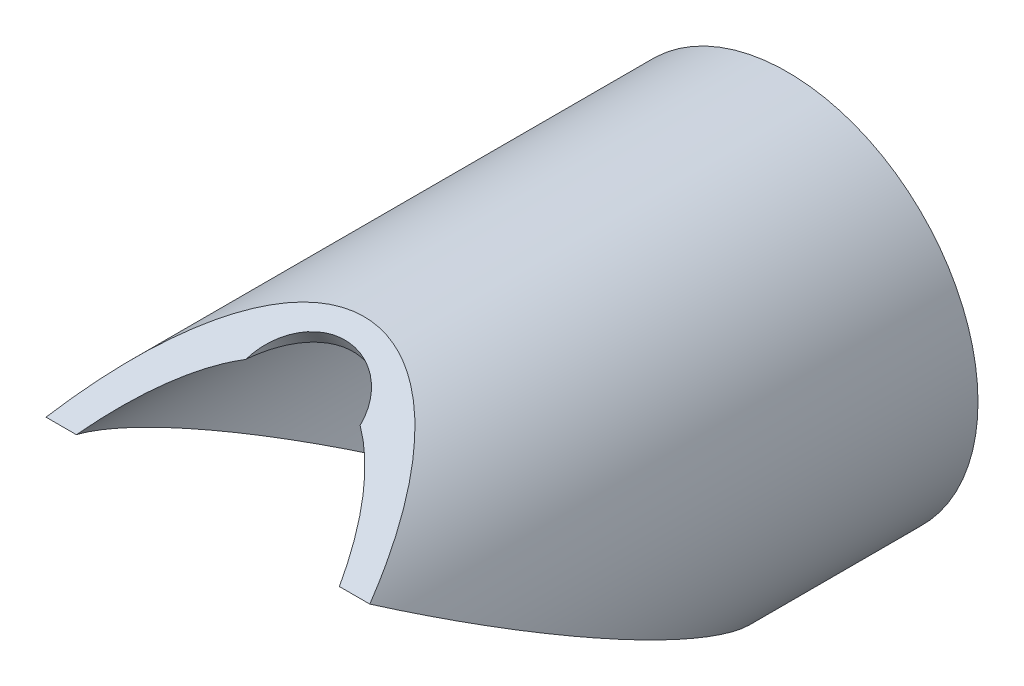
ISO-10303-21;
HEADER;
FILE_DESCRIPTION(('STEP AP214'),'2;1');
FILE_NAME('part.step','',(''),(''),'','','');
FILE_SCHEMA(('AUTOMOTIVE_DESIGN { 1 0 10303 214 1 1 1 1 }'));
ENDSEC;
DATA;
#1=APPLICATION_CONTEXT('core data for automotive mechanical design processes');
#2=APPLICATION_PROTOCOL_DEFINITION('international standard','automotive_design',2000,#1);
#3=PRODUCT_CONTEXT('',#1,'mechanical');
#4=PRODUCT('Part','Part','',(#3));
#5=PRODUCT_RELATED_PRODUCT_CATEGORY('part','',(#4));
#6=PRODUCT_DEFINITION_FORMATION('','',#4);
#7=PRODUCT_DEFINITION_CONTEXT('part definition',#1,'design');
#8=PRODUCT_DEFINITION('design','',#6,#7);
#9=PRODUCT_DEFINITION_SHAPE('','',#8);
#10=(LENGTH_UNIT() NAMED_UNIT(*) SI_UNIT(.MILLI.,.METRE.));
#11=(NAMED_UNIT(*) PLANE_ANGLE_UNIT() SI_UNIT($,.RADIAN.));
#12=(NAMED_UNIT(*) SI_UNIT($,.STERADIAN.) SOLID_ANGLE_UNIT());
#13=UNCERTAINTY_MEASURE_WITH_UNIT(LENGTH_MEASURE(1.E-05),#10,'distance_accuracy_value','');
#14=(GEOMETRIC_REPRESENTATION_CONTEXT(3) GLOBAL_UNCERTAINTY_ASSIGNED_CONTEXT((#13)) GLOBAL_UNIT_ASSIGNED_CONTEXT((#10,
#11,#12)) REPRESENTATION_CONTEXT('',''));
#15=CARTESIAN_POINT('',(0.,0.,0.));
#16=DIRECTION('',(0.,0.,1.));
#17=DIRECTION('',(1.,0.,0.));
#18=AXIS2_PLACEMENT_3D('',#15,#16,#17);
#19=CARTESIAN_POINT('',(0.,0.,-177.8));
#20=DIRECTION('',(0.,0.,1.));
#21=DIRECTION('',(1.,0.,0.));
#22=AXIS2_PLACEMENT_3D('',#19,#20,#21);
#23=CYLINDRICAL_SURFACE('',#22,83.4771);
#24=CARTESIAN_POINT('',(0.,0.,152.4));
#25=DIRECTION('',(0.,-0.866025403784438,-0.500000000000001));
#26=DIRECTION('',(0.,-0.500000000000001,0.866025403784438));
#27=AXIS2_PLACEMENT_3D('',#24,#25,#26);
#28=ELLIPSE('',#27,166.9542,83.4771);
#29=CARTESIAN_POINT('',(70.9432605989462,43.9940905122496,76.1999999999998));
#30=VERTEX_POINT('',#29);
#31=CARTESIAN_POINT('',(-70.9432605989462,43.9940905122495,76.1999999999999));
#32=VERTEX_POINT('',#31);
#33=EDGE_CURVE('E58',#30,#32,#28,.F.);
#34=ORIENTED_EDGE('',*,*,#33,.F.);
#35=CARTESIAN_POINT('',(0.,0.,-1.11022302462516E-13));
#36=DIRECTION('',(0.,0.866025403784438,-0.500000000000001));
#37=DIRECTION('',(0.,0.500000000000001,0.866025403784438));
#38=AXIS2_PLACEMENT_3D('',#35,#36,#37);
#39=ELLIPSE('',#38,166.9542,83.4771);
#40=EDGE_CURVE('E92',#32,#30,#39,.F.);
#41=ORIENTED_EDGE('',*,*,#40,.F.);
#42=EDGE_LOOP('',(#34,#41));
#43=FACE_BOUND('',#42,.T.);
#44=CARTESIAN_POINT('',(0.,0.,-177.8));
#45=DIRECTION('',(0.,0.,1.));
#46=DIRECTION('',(1.,0.,0.));
#47=AXIS2_PLACEMENT_3D('',#44,#45,#46);
#48=CIRCLE('',#47,83.4771);
#49=CARTESIAN_POINT('',(83.4771,0.,-177.8));
#50=VERTEX_POINT('',#49);
#51=EDGE_CURVE('E98',#50,#50,#48,.T.);
#52=ORIENTED_EDGE('',*,*,#51,.T.);
#53=EDGE_LOOP('',(#52));
#54=FACE_BOUND('',#53,.T.);
#55=ADVANCED_FACE('F37',(#43,#54),#23,.T.);
#56=CARTESIAN_POINT('',(0.,0.,-177.8));
#57=DIRECTION('',(0.,0.,1.));
#58=DIRECTION('',(1.,0.,0.));
#59=AXIS2_PLACEMENT_3D('',#56,#57,#58);
#60=PLANE('',#59);
#61=CARTESIAN_POINT('',(0.,0.,-177.8));
#62=DIRECTION('',(0.,0.,1.));
#63=DIRECTION('',(1.,0.,0.));
#64=AXIS2_PLACEMENT_3D('',#61,#62,#63);
#65=CIRCLE('',#64,72.5043);
#66=CARTESIAN_POINT('',(72.5043,0.,-177.8));
#67=VERTEX_POINT('',#66);
#68=EDGE_CURVE('E95',#67,#67,#65,.T.);
#69=ORIENTED_EDGE('',*,*,#68,.T.);
#70=EDGE_LOOP('',(#69));
#71=FACE_BOUND('',#70,.T.);
#72=ORIENTED_EDGE('',*,*,#51,.F.);
#73=EDGE_LOOP('',(#72));
#74=FACE_BOUND('',#73,.T.);
#75=ADVANCED_FACE('F106',(#71,#74),#60,.F.);
#76=CARTESIAN_POINT('',(0.,0.,-177.8));
#77=DIRECTION('',(0.,0.,1.));
#78=DIRECTION('',(1.,0.,0.));
#79=AXIS2_PLACEMENT_3D('',#76,#77,#78);
#80=CYLINDRICAL_SURFACE('',#79,72.5043);
#81=CARTESIAN_POINT('',(0.,0.,152.4));
#82=DIRECTION('',(0.,-0.866025403784438,-0.500000000000001));
#83=DIRECTION('',(0.,-0.500000000000001,0.866025403784438));
#84=AXIS2_PLACEMENT_3D('',#81,#82,#83);
#85=ELLIPSE('',#84,145.0086,72.5043);
#86=CARTESIAN_POINT('',(57.6315323281447,43.9940905122496,76.1999999999998));
#87=VERTEX_POINT('',#86);
#88=CARTESIAN_POINT('',(25.0698350392662,68.0321753995415,34.5648156585567));
#89=VERTEX_POINT('',#88);
#90=EDGE_CURVE('E79',#87,#89,#85,.F.);
#91=ORIENTED_EDGE('',*,*,#90,.T.);
#92=CARTESIAN_POINT('',(25.0698350392662,68.0321753995415,34.5648156585567));
#93=CARTESIAN_POINT('',(25.0165885277715,68.0517928913347,34.1985523659614));
#94=CARTESIAN_POINT('',(24.956740588473,68.0737801424833,33.8334072238118));
#95=CARTESIAN_POINT('',(24.8236149250687,68.1224396249137,33.105860239065));
#96=CARTESIAN_POINT('',(24.7503361582136,68.1491122199519,32.7434586117467));
#97=CARTESIAN_POINT('',(24.5099784340862,68.2360886768719,31.6609956452087));
#98=CARTESIAN_POINT('',(24.3224101262156,68.3033392260635,30.9458993658768));
#99=CARTESIAN_POINT('',(23.8912326372038,68.4553487073951,29.533502917939));
#100=CARTESIAN_POINT('',(23.6475359451464,68.5401349585247,28.836232447922));
#101=CARTESIAN_POINT('',(23.1038219270062,68.7253181299231,27.4662314597167));
#102=CARTESIAN_POINT('',(22.803815304171,68.8257120828981,26.7934963068932));
#103=CARTESIAN_POINT('',(22.1466084736116,69.0399960430664,25.47568013842));
#104=CARTESIAN_POINT('',(21.7892060113447,69.1539333919807,24.8307075414304));
#105=CARTESIAN_POINT('',(21.0192001545897,69.3918512263008,23.5764573624981));
#106=CARTESIAN_POINT('',(20.6065928267358,69.5158324270859,22.9671823284712));
#107=CARTESIAN_POINT('',(19.7289802480364,69.7699730931827,21.7903591552694));
#108=CARTESIAN_POINT('',(19.2640497887339,69.9001235896648,21.2227533251233));
#109=CARTESIAN_POINT('',(18.284338145138,70.1627645627701,20.1329558249374));
#110=CARTESIAN_POINT('',(17.7695601311963,70.2952548901401,19.6107612707016));
#111=CARTESIAN_POINT('',(16.7252920940473,70.5507613544295,18.6448000098467));
#112=CARTESIAN_POINT('',(16.1984110410808,70.6738793897599,18.198235469563));
#113=CARTESIAN_POINT('',(15.1073953921869,70.915105201323,17.3517169776958));
#114=CARTESIAN_POINT('',(14.5432620886039,71.033213151131,16.9517614104966));
#115=CARTESIAN_POINT('',(13.3814627884086,71.2612133547351,16.20060703784));
#116=CARTESIAN_POINT('',(12.7837808053427,71.3711016325495,15.8494317586672));
#117=CARTESIAN_POINT('',(11.5594294623794,71.5795968191336,15.1979439210552));
#118=CARTESIAN_POINT('',(10.932759925942,71.6782036591844,14.8976316724341));
#119=CARTESIAN_POINT('',(9.66090382141489,71.8606242713493,14.3519041162073));
#120=CARTESIAN_POINT('',(9.01594323275082,71.9445669058997,14.1060049434376));
#121=CARTESIAN_POINT('',(7.70657928314601,72.0965776142214,13.6666921339268));
#122=CARTESIAN_POINT('',(7.04217611950407,72.1646458490196,13.4732779647844));
#123=CARTESIAN_POINT('',(5.69867883177629,72.2831464122852,13.1397686482924));
#124=CARTESIAN_POINT('',(5.01958670738071,72.3335811254559,12.9996662909905));
#125=CARTESIAN_POINT('',(3.65135942817979,72.4155424196428,12.7733011821701));
#126=CARTESIAN_POINT('',(2.96222417829195,72.4470688215267,12.6870389407179));
#127=CARTESIAN_POINT('',(1.57199403204947,72.4906246319545,12.5681146715126));
#128=CARTESIAN_POINT('',(0.870847952227655,72.5024621775654,12.5359800659159));
#129=CARTESIAN_POINT('',(-0.531846092435393,72.5057415617375,12.527064172752));
#130=CARTESIAN_POINT('',(-1.23339405971799,72.4971832750567,12.5502832250879));
#131=CARTESIAN_POINT('',(-2.63198124091519,72.4598895008166,12.6519892436832));
#132=CARTESIAN_POINT('',(-3.32902015188525,72.4311526714674,12.7304798852763));
#133=CARTESIAN_POINT('',(-4.71360562256787,72.3542410829171,12.9424263177474));
#134=CARTESIAN_POINT('',(-5.40115218372202,72.3060663266681,13.0758821002776));
#135=CARTESIAN_POINT('',(-6.76375929696585,72.1913696585393,13.3976671298747));
#136=CARTESIAN_POINT('',(-7.43877979200651,72.1247970780674,13.5861480010025));
#137=CARTESIAN_POINT('',(-8.76950645216229,71.9751180190198,14.0170340885756));
#138=CARTESIAN_POINT('',(-9.42521256268965,71.8920114937199,14.2594394574098));
#139=CARTESIAN_POINT('',(-10.7125662950733,71.7114840657611,14.7970692404264));
#140=CARTESIAN_POINT('',(-11.3442138498504,71.6140631231949,15.0922938018646));
#141=CARTESIAN_POINT('',(-12.5788557975641,71.4075464769165,15.7341069734703));
#142=CARTESIAN_POINT('',(-13.1818504327079,71.2984508719172,16.0806951493521));
#143=CARTESIAN_POINT('',(-14.3511756614534,71.0722854503071,16.8210772304806));
#144=CARTESIAN_POINT('',(-14.917710485105,70.95526929688,17.2145649748107));
#145=CARTESIAN_POINT('',(-16.0141548417676,70.7158773116178,18.048177319327));
#146=CARTESIAN_POINT('',(-16.544064514553,70.59350150024,18.4883017415152));
#147=CARTESIAN_POINT('',(-17.563435319644,70.3468139847023,19.4122811465894));
#148=CARTESIAN_POINT('',(-18.0529107454302,70.2225029832589,19.8961205485271));
#149=CARTESIAN_POINT('',(-18.9884401238628,69.9753300947118,20.9044186260631));
#150=CARTESIAN_POINT('',(-19.4344949550721,69.8524681783319,21.4288764794105));
#151=CARTESIAN_POINT('',(-20.2771139566889,69.6125174026009,22.5102526769614));
#152=CARTESIAN_POINT('',(-20.6740533353418,69.4953895208999,23.066870186394));
#153=CARTESIAN_POINT('',(-21.4207527464433,69.2688759616954,24.2124086836965));
#154=CARTESIAN_POINT('',(-21.7705107747348,69.1594906131709,24.8013310423096));
#155=CARTESIAN_POINT('',(-22.4217091516028,68.9511236494955,26.007352678234));
#156=CARTESIAN_POINT('',(-22.7231290674682,68.8521464399604,26.6244637301465));
#157=CARTESIAN_POINT('',(-23.2768744591298,68.6669204181907,27.8820565303071));
#158=CARTESIAN_POINT('',(-23.5292089719207,68.5806692637006,28.5225339507951));
#159=CARTESIAN_POINT('',(-23.9101092247501,68.4485668779816,29.6089397291921));
#160=CARTESIAN_POINT('',(-24.0521175716089,68.3987461933586,30.0497405307472));
#161=CARTESIAN_POINT('',(-24.3142189946274,68.3060143715923,30.938470008998));
#162=CARTESIAN_POINT('',(-24.4343154470696,68.2631021700792,31.3863975759864));
#163=CARTESIAN_POINT('',(-24.6525663768309,68.1845878294803,32.2868336659188));
#164=CARTESIAN_POINT('',(-24.7507817201006,68.1489654356758,32.7393257269689));
#165=CARTESIAN_POINT('',(-24.9260728986618,68.0850398241241,33.6489221155905));
#166=CARTESIAN_POINT('',(-25.0031478627745,68.0567369080097,34.1060266324334));
#167=CARTESIAN_POINT('',(-25.0698350392662,68.0321753995415,34.5648156585566));
#168=B_SPLINE_CURVE_WITH_KNOTS('',3,(#92,#93,#94,#95,#96,#97,#98,#99,#100,#101,#102,#103,#104,
#105,#106,#107,#108,#109,#110,#111,#112,#113,#114,#115,#116,#117,#118,#119,#120,#121,#122,#123,
#124,#125,#126,#127,#128,#129,#130,#131,#132,#133,#134,#135,#136,#137,#138,#139,#140,#141,#142,
#143,#144,#145,#146,#147,#148,#149,#150,#151,#152,#153,#154,#155,#156,#157,#158,#159,#160,#161,
#162,#163,#164,#165,#166,#167),.UNSPECIFIED.,.F.,.F.,(4,2,2,2,2,2,2,2,2,2,2,2,2,2,2,2,2,2,2,2,2,
2,2,2,2,2,2,2,2,2,2,2,2,2,2,2,2,4),(0.,1.11176236341922,2.22361107898201,4.44798387055017,
6.67584848945492,8.90329006960862,11.1387603851449,13.3743900636234,15.6068637407784,
17.8391955236277,19.9413349891026,22.0434015660229,24.1464784562165,26.2495681562587,
28.3331290756161,30.4166688588029,32.4999267613799,34.5832043998689,36.6866666014058,
38.7901417194359,40.8937567231389,42.9973714073638,45.1068383074904,47.2163111689779,
49.3257899115966,51.4352508193223,53.5316264120908,55.6279940039178,57.7236173313396,
59.8191982475513,61.8976263231202,63.9761426578342,66.0555352868735,68.1345447208878,
69.5313210305695,70.9278819366291,72.3205081769468,73.7131917977017),.UNSPECIFIED.);
#169=CARTESIAN_POINT('',(-25.0698350392662,68.0321753995415,34.5648156585567));
#170=VERTEX_POINT('',#169);
#171=EDGE_CURVE('E50',#89,#170,#168,.T.);
#172=ORIENTED_EDGE('',*,*,#171,.T.);
#173=CARTESIAN_POINT('',(-57.6315323281447,43.9940905122495,76.1999999999999));
#174=VERTEX_POINT('',#173);
#175=EDGE_CURVE('E78',#170,#174,#85,.F.);
#176=ORIENTED_EDGE('',*,*,#175,.T.);
#177=CARTESIAN_POINT('',(0.,0.,-1.11022302462516E-13));
#178=DIRECTION('',(0.,0.866025403784438,-0.500000000000001));
#179=DIRECTION('',(0.,0.500000000000001,0.866025403784438));
#180=AXIS2_PLACEMENT_3D('',#177,#178,#179);
#181=ELLIPSE('',#180,145.0086,72.5043);
#182=EDGE_CURVE('E91',#174,#87,#181,.F.);
#183=ORIENTED_EDGE('',*,*,#182,.T.);
#184=EDGE_LOOP('',(#91,#172,#176,#183));
#185=FACE_BOUND('',#184,.T.);
#186=ORIENTED_EDGE('',*,*,#68,.F.);
#187=EDGE_LOOP('',(#186));
#188=FACE_BOUND('',#187,.T.);
#189=ADVANCED_FACE('F75',(#185,#188),#80,.F.);
#190=CARTESIAN_POINT('',(0.,0.,0.));
#191=DIRECTION('',(0.,0.866025403784438,-0.500000000000001));
#192=DIRECTION('',(0.,0.500000000000001,0.866025403784438));
#193=AXIS2_PLACEMENT_3D('',#190,#191,#192);
#194=PLANE('',#193);
#195=ORIENTED_EDGE('',*,*,#40,.T.);
#196=DIRECTION('',(-1.,0.,0.));
#197=VECTOR('',#196,1.);
#198=CARTESIAN_POINT('',(0.,43.9940905122496,76.1999999999998));
#199=LINE('',#198,#197);
#200=EDGE_CURVE('E11',#30,#87,#199,.T.);
#201=ORIENTED_EDGE('',*,*,#200,.T.);
#202=ORIENTED_EDGE('',*,*,#182,.F.);
#203=EDGE_CURVE('E40',#174,#32,#199,.T.);
#204=ORIENTED_EDGE('',*,*,#203,.T.);
#205=EDGE_LOOP('',(#195,#201,#202,#204));
#206=FACE_BOUND('',#205,.T.);
#207=ADVANCED_FACE('F101',(#206),#194,.F.);
#208=CARTESIAN_POINT('',(0.,65.9911357683742,38.1000000000001));
#209=DIRECTION('',(0.,-0.866025403784438,-0.500000000000001));
#210=DIRECTION('',(0.,0.500000000000001,-0.866025403784438));
#211=AXIS2_PLACEMENT_3D('',#208,#209,#210);
#212=PLANE('',#211);
#213=ORIENTED_EDGE('',*,*,#175,.F.);
#214=CARTESIAN_POINT('',(0.,65.9911357683742,38.1000000000001));
#215=DIRECTION('',(0.,0.866025403784438,0.500000000000001));
#216=DIRECTION('',(0.,-0.500000000000001,0.866025403784438));
#217=AXIS2_PLACEMENT_3D('',#214,#215,#216);
#218=CIRCLE('',#217,25.4);
#219=EDGE_CURVE('E69',#89,#170,#218,.T.);
#220=ORIENTED_EDGE('',*,*,#219,.F.);
#221=ORIENTED_EDGE('',*,*,#90,.F.);
#222=ORIENTED_EDGE('',*,*,#200,.F.);
#223=ORIENTED_EDGE('',*,*,#33,.T.);
#224=ORIENTED_EDGE('',*,*,#203,.F.);
#225=EDGE_LOOP('',(#213,#220,#221,#222,#223,#224));
#226=FACE_BOUND('',#225,.T.);
#227=ADVANCED_FACE('F81',(#226),#212,.F.);
#228=CARTESIAN_POINT('',(0.,-139.597483396437,-80.5966446171272));
#229=DIRECTION('',(0.,0.866025403784438,0.500000000000001));
#230=DIRECTION('',(0.,-0.500000000000001,0.866025403784438));
#231=AXIS2_PLACEMENT_3D('',#228,#229,#230);
#232=CYLINDRICAL_SURFACE('',#231,25.4);
#233=ORIENTED_EDGE('',*,*,#219,.T.);
#234=ORIENTED_EDGE('',*,*,#171,.F.);
#235=EDGE_LOOP('',(#233,#234));
#236=FACE_BOUND('',#235,.T.);
#237=ADVANCED_FACE('F70',(#236),#232,.F.);
#238=CLOSED_SHELL('',(#55,#75,#189,#207,#227,#237));
#239=MANIFOLD_SOLID_BREP('B2',#238);
#240=ADVANCED_BREP_SHAPE_REPRESENTATION('',(#18,#239),#14);
#241=SHAPE_DEFINITION_REPRESENTATION(#9,#240);
ENDSEC;
END-ISO-10303-21;
